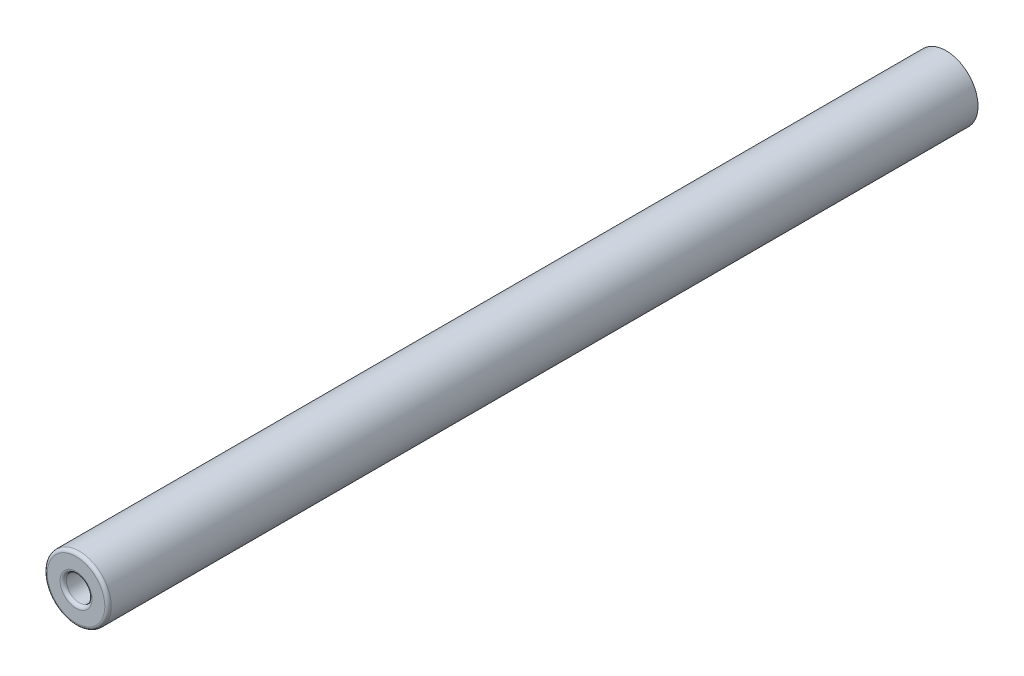
ISO-10303-21;
HEADER;
FILE_DESCRIPTION(('STEP AP214'),'2;1');
FILE_NAME('part.step','',(''),(''),'','','');
FILE_SCHEMA(('AUTOMOTIVE_DESIGN { 1 0 10303 214 1 1 1 1 }'));
ENDSEC;
DATA;
#1=APPLICATION_CONTEXT('core data for automotive mechanical design processes');
#2=APPLICATION_PROTOCOL_DEFINITION('international standard','automotive_design',2000,#1);
#3=PRODUCT_CONTEXT('',#1,'mechanical');
#4=PRODUCT('Part','Part','',(#3));
#5=PRODUCT_RELATED_PRODUCT_CATEGORY('part','',(#4));
#6=PRODUCT_DEFINITION_FORMATION('','',#4);
#7=PRODUCT_DEFINITION_CONTEXT('part definition',#1,'design');
#8=PRODUCT_DEFINITION('design','',#6,#7);
#9=PRODUCT_DEFINITION_SHAPE('','',#8);
#10=(LENGTH_UNIT() NAMED_UNIT(*) SI_UNIT(.MILLI.,.METRE.));
#11=(NAMED_UNIT(*) PLANE_ANGLE_UNIT() SI_UNIT($,.RADIAN.));
#12=(NAMED_UNIT(*) SI_UNIT($,.STERADIAN.) SOLID_ANGLE_UNIT());
#13=UNCERTAINTY_MEASURE_WITH_UNIT(LENGTH_MEASURE(1.E-05),#10,'distance_accuracy_value','');
#14=(GEOMETRIC_REPRESENTATION_CONTEXT(3) GLOBAL_UNCERTAINTY_ASSIGNED_CONTEXT((#13)) GLOBAL_UNIT_ASSIGNED_CONTEXT((#10,
#11,#12)) REPRESENTATION_CONTEXT('',''));
#15=CARTESIAN_POINT('',(0.,0.,0.));
#16=DIRECTION('',(0.,0.,1.));
#17=DIRECTION('',(1.,0.,0.));
#18=AXIS2_PLACEMENT_3D('',#15,#16,#17);
#19=CARTESIAN_POINT('',(0.,0.,136.));
#20=DIRECTION('',(0.,0.,-1.));
#21=DIRECTION('',(-1.,0.,0.));
#22=AXIS2_PLACEMENT_3D('',#19,#20,#21);
#23=CYLINDRICAL_SURFACE('',#22,5.);
#24=CARTESIAN_POINT('',(0.,0.,135.5));
#25=DIRECTION('',(0.,0.,1.));
#26=DIRECTION('',(1.,0.,0.));
#27=AXIS2_PLACEMENT_3D('',#24,#25,#26);
#28=CIRCLE('',#27,5.);
#29=CARTESIAN_POINT('',(5.,0.,135.5));
#30=VERTEX_POINT('',#29);
#31=EDGE_CURVE('E43',#30,#30,#28,.F.);
#32=ORIENTED_EDGE('',*,*,#31,.T.);
#33=EDGE_LOOP('',(#32));
#34=FACE_BOUND('',#33,.T.);
#35=CARTESIAN_POINT('',(0.,0.,0.));
#36=DIRECTION('',(0.,0.,1.));
#37=DIRECTION('',(1.,0.,0.));
#38=AXIS2_PLACEMENT_3D('',#35,#36,#37);
#39=CIRCLE('',#38,5.);
#40=CARTESIAN_POINT('',(5.,0.,0.));
#41=VERTEX_POINT('',#40);
#42=EDGE_CURVE('E52',#41,#41,#39,.T.);
#43=ORIENTED_EDGE('',*,*,#42,.T.);
#44=EDGE_LOOP('',(#43));
#45=FACE_BOUND('',#44,.T.);
#46=ADVANCED_FACE('F32',(#34,#45),#23,.T.);
#47=CARTESIAN_POINT('',(0.,0.,136.));
#48=DIRECTION('',(0.,0.,1.));
#49=DIRECTION('',(1.,0.,0.));
#50=AXIS2_PLACEMENT_3D('',#47,#48,#49);
#51=PLANE('',#50);
#52=CARTESIAN_POINT('',(0.,0.,136.));
#53=DIRECTION('',(0.,0.,1.));
#54=DIRECTION('',(1.,0.,0.));
#55=AXIS2_PLACEMENT_3D('',#52,#53,#54);
#56=CIRCLE('',#55,2.5);
#57=CARTESIAN_POINT('',(2.5,0.,136.));
#58=VERTEX_POINT('',#57);
#59=EDGE_CURVE('E10',#58,#58,#56,.F.);
#60=ORIENTED_EDGE('',*,*,#59,.T.);
#61=EDGE_LOOP('',(#60));
#62=FACE_BOUND('',#61,.T.);
#63=CARTESIAN_POINT('',(0.,0.,136.));
#64=DIRECTION('',(0.,0.,1.));
#65=DIRECTION('',(1.,0.,0.));
#66=AXIS2_PLACEMENT_3D('',#63,#64,#65);
#67=CIRCLE('',#66,4.5);
#68=CARTESIAN_POINT('',(4.5,0.,136.));
#69=VERTEX_POINT('',#68);
#70=EDGE_CURVE('E47',#69,#69,#67,.T.);
#71=ORIENTED_EDGE('',*,*,#70,.T.);
#72=EDGE_LOOP('',(#71));
#73=FACE_BOUND('',#72,.T.);
#74=ADVANCED_FACE('F71',(#62,#73),#51,.T.);
#75=CARTESIAN_POINT('',(0.,0.,0.));
#76=DIRECTION('',(0.,0.,1.));
#77=DIRECTION('',(1.,0.,0.));
#78=AXIS2_PLACEMENT_3D('',#75,#76,#77);
#79=PLANE('',#78);
#80=ORIENTED_EDGE('',*,*,#42,.F.);
#81=EDGE_LOOP('',(#80));
#82=FACE_BOUND('',#81,.T.);
#83=ADVANCED_FACE('F63',(#82),#79,.F.);
#84=CARTESIAN_POINT('',(0.,0.,116.));
#85=DIRECTION('',(0.,0.,1.));
#86=DIRECTION('',(1.,0.,0.));
#87=AXIS2_PLACEMENT_3D('',#84,#85,#86);
#88=CYLINDRICAL_SURFACE('',#87,2.);
#89=CARTESIAN_POINT('',(0.,0.,135.5));
#90=DIRECTION('',(0.,0.,1.));
#91=DIRECTION('',(1.,0.,0.));
#92=AXIS2_PLACEMENT_3D('',#89,#90,#91);
#93=CIRCLE('',#92,2.);
#94=CARTESIAN_POINT('',(2.,0.,135.5));
#95=VERTEX_POINT('',#94);
#96=EDGE_CURVE('E39',#95,#95,#93,.T.);
#97=ORIENTED_EDGE('',*,*,#96,.T.);
#98=EDGE_LOOP('',(#97));
#99=FACE_BOUND('',#98,.T.);
#100=CARTESIAN_POINT('',(0.,0.,116.));
#101=DIRECTION('',(0.,0.,1.));
#102=DIRECTION('',(1.,0.,0.));
#103=AXIS2_PLACEMENT_3D('',#100,#101,#102);
#104=CIRCLE('',#103,2.);
#105=CARTESIAN_POINT('',(2.,0.,116.));
#106=VERTEX_POINT('',#105);
#107=EDGE_CURVE('E55',#106,#106,#104,.T.);
#108=ORIENTED_EDGE('',*,*,#107,.F.);
#109=EDGE_LOOP('',(#108));
#110=FACE_BOUND('',#109,.T.);
#111=ADVANCED_FACE('F61',(#99,#110),#88,.F.);
#112=CARTESIAN_POINT('',(0.,0.,116.));
#113=DIRECTION('',(0.,0.,1.));
#114=DIRECTION('',(1.,0.,0.));
#115=AXIS2_PLACEMENT_3D('',#112,#113,#114);
#116=PLANE('',#115);
#117=ORIENTED_EDGE('',*,*,#107,.T.);
#118=EDGE_LOOP('',(#117));
#119=FACE_BOUND('',#118,.T.);
#120=ADVANCED_FACE('F59',(#119),#116,.T.);
#121=CARTESIAN_POINT('',(0.,0.,135.5));
#122=DIRECTION('',(0.,0.,1.));
#123=DIRECTION('',(1.,0.,0.));
#124=AXIS2_PLACEMENT_3D('',#121,#122,#123);
#125=TOROIDAL_SURFACE('',#124,4.5,0.5);
#126=ORIENTED_EDGE('',*,*,#31,.F.);
#127=EDGE_LOOP('',(#126));
#128=FACE_BOUND('',#127,.T.);
#129=ORIENTED_EDGE('',*,*,#70,.F.);
#130=EDGE_LOOP('',(#129));
#131=FACE_BOUND('',#130,.T.);
#132=ADVANCED_FACE('F69',(#128,#131),#125,.T.);
#133=CARTESIAN_POINT('',(0.,0.,135.5));
#134=DIRECTION('',(0.,0.,1.));
#135=DIRECTION('',(1.,0.,0.));
#136=AXIS2_PLACEMENT_3D('',#133,#134,#135);
#137=TOROIDAL_SURFACE('',#136,2.5,0.5);
#138=ORIENTED_EDGE('',*,*,#59,.F.);
#139=EDGE_LOOP('',(#138));
#140=FACE_BOUND('',#139,.T.);
#141=ORIENTED_EDGE('',*,*,#96,.F.);
#142=EDGE_LOOP('',(#141));
#143=FACE_BOUND('',#142,.T.);
#144=ADVANCED_FACE('F34',(#140,#143),#137,.T.);
#145=CLOSED_SHELL('',(#46,#74,#83,#111,#120,#132,#144));
#146=MANIFOLD_SOLID_BREP('B2',#145);
#147=ADVANCED_BREP_SHAPE_REPRESENTATION('',(#18,#146),#14);
#148=SHAPE_DEFINITION_REPRESENTATION(#9,#147);
ENDSEC;
END-ISO-10303-21;
